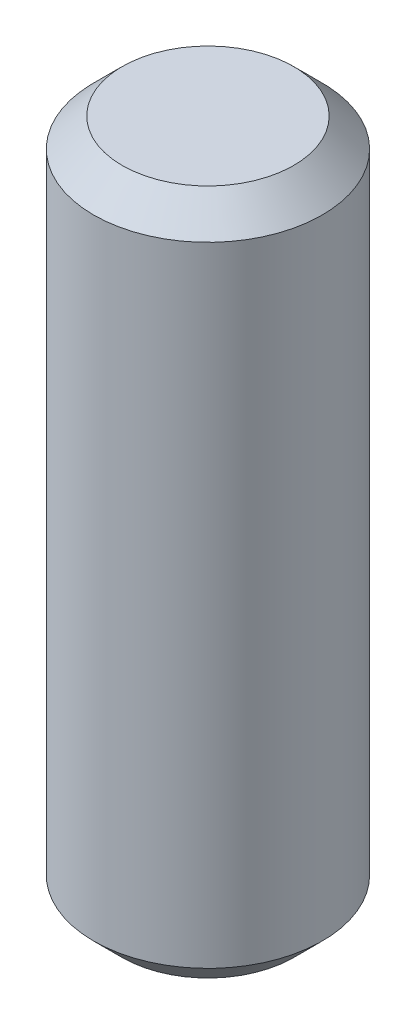
ISO-10303-21;
HEADER;
FILE_DESCRIPTION(('STEP AP214'),'2;1');
FILE_NAME('part.step','',(''),(''),'','','');
FILE_SCHEMA(('AUTOMOTIVE_DESIGN { 1 0 10303 214 1 1 1 1 }'));
ENDSEC;
DATA;
#1=APPLICATION_CONTEXT('core data for automotive mechanical design processes');
#2=APPLICATION_PROTOCOL_DEFINITION('international standard','automotive_design',2000,#1);
#3=PRODUCT_CONTEXT('',#1,'mechanical');
#4=PRODUCT('Part','Part','',(#3));
#5=PRODUCT_RELATED_PRODUCT_CATEGORY('part','',(#4));
#6=PRODUCT_DEFINITION_FORMATION('','',#4);
#7=PRODUCT_DEFINITION_CONTEXT('part definition',#1,'design');
#8=PRODUCT_DEFINITION('design','',#6,#7);
#9=PRODUCT_DEFINITION_SHAPE('','',#8);
#10=(LENGTH_UNIT() NAMED_UNIT(*) SI_UNIT(.MILLI.,.METRE.));
#11=(NAMED_UNIT(*) PLANE_ANGLE_UNIT() SI_UNIT($,.RADIAN.));
#12=(NAMED_UNIT(*) SI_UNIT($,.STERADIAN.) SOLID_ANGLE_UNIT());
#13=UNCERTAINTY_MEASURE_WITH_UNIT(LENGTH_MEASURE(1.E-05),#10,'distance_accuracy_value','');
#14=(GEOMETRIC_REPRESENTATION_CONTEXT(3) GLOBAL_UNCERTAINTY_ASSIGNED_CONTEXT((#13)) GLOBAL_UNIT_ASSIGNED_CONTEXT((#10,
#11,#12)) REPRESENTATION_CONTEXT('',''));
#15=CARTESIAN_POINT('',(0.,0.,0.));
#16=DIRECTION('',(0.,0.,1.));
#17=DIRECTION('',(1.,0.,0.));
#18=AXIS2_PLACEMENT_3D('',#15,#16,#17);
#19=CARTESIAN_POINT('',(0.,12.,0.));
#20=DIRECTION('',(0.,-1.,0.));
#21=DIRECTION('',(0.,0.,-1.));
#22=AXIS2_PLACEMENT_3D('',#19,#20,#21);
#23=CYLINDRICAL_SURFACE('',#22,2.);
#24=CARTESIAN_POINT('',(0.,11.5,0.));
#25=DIRECTION('',(0.,1.,0.));
#26=DIRECTION('',(0.,0.,1.));
#27=AXIS2_PLACEMENT_3D('',#24,#25,#26);
#28=CIRCLE('',#27,2.);
#29=CARTESIAN_POINT('',(0.,11.5,2.));
#30=VERTEX_POINT('',#29);
#31=EDGE_CURVE('E44',#30,#30,#28,.F.);
#32=ORIENTED_EDGE('',*,*,#31,.T.);
#33=EDGE_LOOP('',(#32));
#34=FACE_BOUND('',#33,.T.);
#35=CARTESIAN_POINT('',(0.,0.500000000000002,0.));
#36=DIRECTION('',(0.,1.,0.));
#37=DIRECTION('',(0.,0.,1.));
#38=AXIS2_PLACEMENT_3D('',#35,#36,#37);
#39=CIRCLE('',#38,2.);
#40=CARTESIAN_POINT('',(0.,0.500000000000002,2.));
#41=VERTEX_POINT('',#40);
#42=EDGE_CURVE('E49',#41,#41,#39,.T.);
#43=ORIENTED_EDGE('',*,*,#42,.T.);
#44=EDGE_LOOP('',(#43));
#45=FACE_BOUND('',#44,.T.);
#46=ADVANCED_FACE('F36',(#34,#45),#23,.T.);
#47=CARTESIAN_POINT('',(0.,12.,0.));
#48=DIRECTION('',(0.,1.,0.));
#49=DIRECTION('',(0.,0.,1.));
#50=AXIS2_PLACEMENT_3D('',#47,#48,#49);
#51=PLANE('',#50);
#52=CARTESIAN_POINT('',(0.,12.,0.));
#53=DIRECTION('',(0.,1.,0.));
#54=DIRECTION('',(0.,0.,1.));
#55=AXIS2_PLACEMENT_3D('',#52,#53,#54);
#56=CIRCLE('',#55,1.5);
#57=CARTESIAN_POINT('',(0.,12.,1.5));
#58=VERTEX_POINT('',#57);
#59=EDGE_CURVE('E54',#58,#58,#56,.T.);
#60=ORIENTED_EDGE('',*,*,#59,.T.);
#61=EDGE_LOOP('',(#60));
#62=FACE_BOUND('',#61,.T.);
#63=ADVANCED_FACE('F61',(#62),#51,.T.);
#64=CARTESIAN_POINT('',(0.,0.,0.));
#65=DIRECTION('',(0.,1.,0.));
#66=DIRECTION('',(0.,0.,1.));
#67=AXIS2_PLACEMENT_3D('',#64,#65,#66);
#68=PLANE('',#67);
#69=CARTESIAN_POINT('',(0.,0.,0.));
#70=DIRECTION('',(0.,1.,0.));
#71=DIRECTION('',(0.,0.,1.));
#72=AXIS2_PLACEMENT_3D('',#69,#70,#71);
#73=CIRCLE('',#72,1.5);
#74=CARTESIAN_POINT('',(0.,0.,1.5));
#75=VERTEX_POINT('',#74);
#76=EDGE_CURVE('E10',#75,#75,#73,.F.);
#77=ORIENTED_EDGE('',*,*,#76,.T.);
#78=EDGE_LOOP('',(#77));
#79=FACE_BOUND('',#78,.T.);
#80=ADVANCED_FACE('F65',(#79),#68,.F.);
#81=CARTESIAN_POINT('',(0.,12.,0.));
#82=DIRECTION('',(0.,-1.,0.));
#83=DIRECTION('',(0.,0.,-1.));
#84=AXIS2_PLACEMENT_3D('',#81,#82,#83);
#85=CONICAL_SURFACE('',#84,1.5,0.785398163397447);
#86=ORIENTED_EDGE('',*,*,#31,.F.);
#87=EDGE_LOOP('',(#86));
#88=FACE_BOUND('',#87,.T.);
#89=ORIENTED_EDGE('',*,*,#59,.F.);
#90=EDGE_LOOP('',(#89));
#91=FACE_BOUND('',#90,.T.);
#92=ADVANCED_FACE('F63',(#88,#91),#85,.T.);
#93=CARTESIAN_POINT('',(0.,0.500000000000002,0.));
#94=DIRECTION('',(0.,1.,0.));
#95=DIRECTION('',(0.,0.,1.));
#96=AXIS2_PLACEMENT_3D('',#93,#94,#95);
#97=CONICAL_SURFACE('',#96,2.,0.78539816339745);
#98=ORIENTED_EDGE('',*,*,#76,.F.);
#99=EDGE_LOOP('',(#98));
#100=FACE_BOUND('',#99,.T.);
#101=ORIENTED_EDGE('',*,*,#42,.F.);
#102=EDGE_LOOP('',(#101));
#103=FACE_BOUND('',#102,.T.);
#104=ADVANCED_FACE('F38',(#100,#103),#97,.T.);
#105=CLOSED_SHELL('',(#46,#63,#80,#92,#104));
#106=MANIFOLD_SOLID_BREP('B2',#105);
#107=ADVANCED_BREP_SHAPE_REPRESENTATION('',(#18,#106),#14);
#108=SHAPE_DEFINITION_REPRESENTATION(#9,#107);
ENDSEC;
END-ISO-10303-21;
